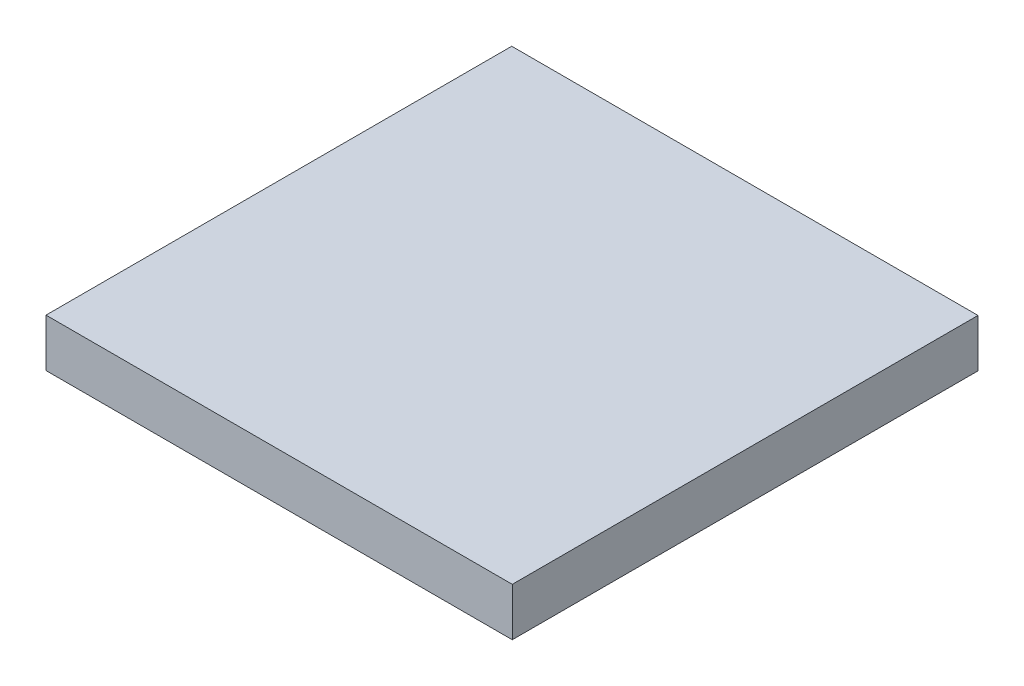
ISO-10303-21;
HEADER;
FILE_DESCRIPTION(('STEP AP214'),'2;1');
FILE_NAME('part.step','',(''),(''),'','','');
FILE_SCHEMA(('AUTOMOTIVE_DESIGN { 1 0 10303 214 1 1 1 1 }'));
ENDSEC;
DATA;
#1=APPLICATION_CONTEXT('core data for automotive mechanical design processes');
#2=APPLICATION_PROTOCOL_DEFINITION('international standard','automotive_design',2000,#1);
#3=PRODUCT_CONTEXT('',#1,'mechanical');
#4=PRODUCT('Part','Part','',(#3));
#5=PRODUCT_RELATED_PRODUCT_CATEGORY('part','',(#4));
#6=PRODUCT_DEFINITION_FORMATION('','',#4);
#7=PRODUCT_DEFINITION_CONTEXT('part definition',#1,'design');
#8=PRODUCT_DEFINITION('design','',#6,#7);
#9=PRODUCT_DEFINITION_SHAPE('','',#8);
#10=(LENGTH_UNIT() NAMED_UNIT(*) SI_UNIT(.MILLI.,.METRE.));
#11=(NAMED_UNIT(*) PLANE_ANGLE_UNIT() SI_UNIT($,.RADIAN.));
#12=(NAMED_UNIT(*) SI_UNIT($,.STERADIAN.) SOLID_ANGLE_UNIT());
#13=UNCERTAINTY_MEASURE_WITH_UNIT(LENGTH_MEASURE(1.E-05),#10,'distance_accuracy_value','');
#14=(GEOMETRIC_REPRESENTATION_CONTEXT(3) GLOBAL_UNCERTAINTY_ASSIGNED_CONTEXT((#13)) GLOBAL_UNIT_ASSIGNED_CONTEXT((#10,
#11,#12)) REPRESENTATION_CONTEXT('',''));
#15=CARTESIAN_POINT('',(0.,0.,0.));
#16=DIRECTION('',(0.,0.,1.));
#17=DIRECTION('',(1.,0.,0.));
#18=AXIS2_PLACEMENT_3D('',#15,#16,#17);
#19=CARTESIAN_POINT('',(0.,0.,0.));
#20=DIRECTION('',(0.,-1.,0.));
#21=DIRECTION('',(0.,0.,-1.));
#22=AXIS2_PLACEMENT_3D('',#19,#20,#21);
#23=PLANE('',#22);
#24=CARTESIAN_POINT('',(23.4823,0.,-118.7323));
#25=DIRECTION('',(0.,-1.,0.));
#26=DIRECTION('',(0.,0.,-1.));
#27=AXIS2_PLACEMENT_3D('',#24,#25,#26);
#28=CIRCLE('',#27,1.5113);
#29=CARTESIAN_POINT('',(23.4823,0.,-120.2436));
#30=VERTEX_POINT('',#29);
#31=EDGE_CURVE('E495',#30,#30,#28,.T.);
#32=ORIENTED_EDGE('',*,*,#31,.F.);
#33=EDGE_LOOP('',(#32));
#34=FACE_BOUND('',#33,.T.);
#35=CARTESIAN_POINT('',(119.7356,0.,-19.0499999999996));
#36=DIRECTION('',(0.,-1.,0.));
#37=DIRECTION('',(0.,0.,-1.));
#38=AXIS2_PLACEMENT_3D('',#35,#36,#37);
#39=CIRCLE('',#38,1.27000000000001);
#40=CARTESIAN_POINT('',(119.7356,0.,-20.3199999999996));
#41=VERTEX_POINT('',#40);
#42=EDGE_CURVE('E286',#41,#41,#39,.T.);
#43=ORIENTED_EDGE('',*,*,#42,.F.);
#44=EDGE_LOOP('',(#43));
#45=FACE_BOUND('',#44,.T.);
#46=CARTESIAN_POINT('',(119.735600000001,0.,-108.7882));
#47=DIRECTION('',(0.,-1.,0.));
#48=DIRECTION('',(0.,0.,1.));
#49=AXIS2_PLACEMENT_3D('',#46,#47,#48);
#50=CIRCLE('',#49,1.27000000000001);
#51=CARTESIAN_POINT('',(119.735600000001,0.,-107.5182));
#52=VERTEX_POINT('',#51);
#53=EDGE_CURVE('E290',#52,#52,#50,.T.);
#54=ORIENTED_EDGE('',*,*,#53,.F.);
#55=EDGE_LOOP('',(#54));
#56=FACE_BOUND('',#55,.T.);
#57=CARTESIAN_POINT('',(8.25499999999997,0.,-19.05));
#58=DIRECTION('',(0.,-1.,0.));
#59=DIRECTION('',(0.,0.,1.));
#60=AXIS2_PLACEMENT_3D('',#57,#58,#59);
#61=CIRCLE('',#60,1.27000000000001);
#62=CARTESIAN_POINT('',(8.25499999999997,0.,-17.78));
#63=VERTEX_POINT('',#62);
#64=EDGE_CURVE('E296',#63,#63,#61,.T.);
#65=ORIENTED_EDGE('',*,*,#64,.F.);
#66=EDGE_LOOP('',(#65));
#67=FACE_BOUND('',#66,.T.);
#68=CARTESIAN_POINT('',(8.25499999999997,0.,-108.7882));
#69=DIRECTION('',(0.,-1.,0.));
#70=DIRECTION('',(0.,0.,-1.));
#71=AXIS2_PLACEMENT_3D('',#68,#69,#70);
#72=CIRCLE('',#71,1.27000000000001);
#73=CARTESIAN_POINT('',(8.25499999999997,0.,-110.0582));
#74=VERTEX_POINT('',#73);
#75=EDGE_CURVE('E302',#74,#74,#72,.T.);
#76=ORIENTED_EDGE('',*,*,#75,.F.);
#77=EDGE_LOOP('',(#76));
#78=FACE_BOUND('',#77,.T.);
#79=DIRECTION('',(0.,0.,-1.));
#80=VECTOR('',#79,1.);
#81=CARTESIAN_POINT('',(12.7,0.,-12.7));
#82=LINE('',#81,#80);
#83=CARTESIAN_POINT('',(12.7,0.,-13.97));
#84=VERTEX_POINT('',#83);
#85=CARTESIAN_POINT('',(12.7,0.,-113.8682));
#86=VERTEX_POINT('',#85);
#87=EDGE_CURVE('E308',#84,#86,#82,.T.);
#88=ORIENTED_EDGE('',*,*,#87,.F.);
#89=CARTESIAN_POINT('',(13.97,0.,-13.97));
#90=DIRECTION('',(0.,-1.,0.));
#91=DIRECTION('',(0.,0.,-1.));
#92=AXIS2_PLACEMENT_3D('',#89,#90,#91);
#93=CIRCLE('',#92,1.27);
#94=CARTESIAN_POINT('',(13.97,0.,-12.7));
#95=VERTEX_POINT('',#94);
#96=EDGE_CURVE('E375',#84,#95,#93,.F.);
#97=ORIENTED_EDGE('',*,*,#96,.T.);
#98=DIRECTION('',(-1.,0.,0.));
#99=VECTOR('',#98,1.);
#100=CARTESIAN_POINT('',(12.7,0.,-12.7));
#101=LINE('',#100,#99);
#102=CARTESIAN_POINT('',(114.0206,0.,-12.7));
#103=VERTEX_POINT('',#102);
#104=EDGE_CURVE('E314',#103,#95,#101,.T.);
#105=ORIENTED_EDGE('',*,*,#104,.F.);
#106=CARTESIAN_POINT('',(114.0206,0.,-13.97));
#107=DIRECTION('',(0.,-1.,0.));
#108=DIRECTION('',(0.,0.,-1.));
#109=AXIS2_PLACEMENT_3D('',#106,#107,#108);
#110=CIRCLE('',#109,1.27);
#111=CARTESIAN_POINT('',(115.2906,0.,-13.97));
#112=VERTEX_POINT('',#111);
#113=EDGE_CURVE('E386',#103,#112,#110,.F.);
#114=ORIENTED_EDGE('',*,*,#113,.T.);
#115=DIRECTION('',(0.,0.,1.));
#116=VECTOR('',#115,1.);
#117=CARTESIAN_POINT('',(115.2906,0.,-12.7));
#118=LINE('',#117,#116);
#119=CARTESIAN_POINT('',(115.2906,0.,-113.8682));
#120=VERTEX_POINT('',#119);
#121=EDGE_CURVE('E324',#120,#112,#118,.T.);
#122=ORIENTED_EDGE('',*,*,#121,.F.);
#123=CARTESIAN_POINT('',(114.0206,0.,-113.8682));
#124=DIRECTION('',(0.,-1.,0.));
#125=DIRECTION('',(0.,0.,-1.));
#126=AXIS2_PLACEMENT_3D('',#123,#124,#125);
#127=CIRCLE('',#126,1.27);
#128=CARTESIAN_POINT('',(114.0206,0.,-115.1382));
#129=VERTEX_POINT('',#128);
#130=EDGE_CURVE('E50',#120,#129,#127,.F.);
#131=ORIENTED_EDGE('',*,*,#130,.T.);
#132=DIRECTION('',(1.,0.,0.));
#133=VECTOR('',#132,1.);
#134=CARTESIAN_POINT('',(12.7,0.,-115.1382));
#135=LINE('',#134,#133);
#136=CARTESIAN_POINT('',(13.97,0.,-115.1382));
#137=VERTEX_POINT('',#136);
#138=EDGE_CURVE('E322',#137,#129,#135,.T.);
#139=ORIENTED_EDGE('',*,*,#138,.F.);
#140=CARTESIAN_POINT('',(13.97,0.,-113.8682));
#141=DIRECTION('',(0.,-1.,0.));
#142=DIRECTION('',(0.,0.,-1.));
#143=AXIS2_PLACEMENT_3D('',#140,#141,#142);
#144=CIRCLE('',#143,1.27);
#145=EDGE_CURVE('E364',#137,#86,#144,.F.);
#146=ORIENTED_EDGE('',*,*,#145,.T.);
#147=EDGE_LOOP('',(#88,#97,#105,#114,#122,#131,#139,#146));
#148=FACE_BOUND('',#147,.T.);
#149=DIRECTION('',(0.,0.,1.));
#150=VECTOR('',#149,1.);
#151=CARTESIAN_POINT('',(0.,0.,0.));
#152=LINE('',#151,#150);
#153=CARTESIAN_POINT('',(0.,0.,-127.8382));
#154=VERTEX_POINT('',#153);
#155=CARTESIAN_POINT('',(0.,0.,0.));
#156=VERTEX_POINT('',#155);
#157=EDGE_CURVE('E320',#154,#156,#152,.T.);
#158=ORIENTED_EDGE('',*,*,#157,.F.);
#159=DIRECTION('',(-1.,0.,0.));
#160=VECTOR('',#159,1.);
#161=CARTESIAN_POINT('',(0.,0.,-127.8382));
#162=LINE('',#161,#160);
#163=CARTESIAN_POINT('',(127.9906,0.,-127.8382));
#164=VERTEX_POINT('',#163);
#165=EDGE_CURVE('E331',#164,#154,#162,.T.);
#166=ORIENTED_EDGE('',*,*,#165,.F.);
#167=DIRECTION('',(0.,0.,-1.));
#168=VECTOR('',#167,1.);
#169=CARTESIAN_POINT('',(127.9906,0.,0.));
#170=LINE('',#169,#168);
#171=CARTESIAN_POINT('',(127.9906,0.,0.));
#172=VERTEX_POINT('',#171);
#173=EDGE_CURVE('E342',#172,#164,#170,.T.);
#174=ORIENTED_EDGE('',*,*,#173,.F.);
#175=DIRECTION('',(1.,0.,0.));
#176=VECTOR('',#175,1.);
#177=CARTESIAN_POINT('',(0.,0.,0.));
#178=LINE('',#177,#176);
#179=EDGE_CURVE('E340',#156,#172,#178,.T.);
#180=ORIENTED_EDGE('',*,*,#179,.F.);
#181=EDGE_LOOP('',(#158,#166,#174,#180));
#182=FACE_BOUND('',#181,.T.);
#183=CARTESIAN_POINT('',(104.5083,0.,-9.10590000000028));
#184=DIRECTION('',(0.,-1.,0.));
#185=DIRECTION('',(0.,0.,-1.));
#186=AXIS2_PLACEMENT_3D('',#183,#184,#185);
#187=CIRCLE('',#186,1.51130000000001);
#188=CARTESIAN_POINT('',(104.5083,0.,-10.6172000000003));
#189=VERTEX_POINT('',#188);
#190=EDGE_CURVE('E493',#189,#189,#187,.T.);
#191=ORIENTED_EDGE('',*,*,#190,.F.);
#192=EDGE_LOOP('',(#191));
#193=FACE_BOUND('',#192,.T.);
#194=ADVANCED_FACE('F35',(#34,#45,#56,#67,#78,#148,#182,#193),#23,.T.);
#195=CARTESIAN_POINT('',(0.,7.874,0.));
#196=DIRECTION('',(0.,-1.,0.));
#197=DIRECTION('',(0.,0.,-1.));
#198=AXIS2_PLACEMENT_3D('',#195,#196,#197);
#199=PLANE('',#198);
#200=DIRECTION('',(1.,0.,0.));
#201=VECTOR('',#200,1.);
#202=CARTESIAN_POINT('',(13.2842,7.874,-79.9084));
#203=LINE('',#202,#201);
#204=CARTESIAN_POINT('',(13.2842,7.874,-79.9084));
#205=VERTEX_POINT('',#204);
#206=CARTESIAN_POINT('',(22.1742,7.874,-79.9084));
#207=VERTEX_POINT('',#206);
#208=EDGE_CURVE('E226',#205,#207,#203,.T.);
#209=ORIENTED_EDGE('',*,*,#208,.F.);
#210=DIRECTION('',(0.,0.,-1.));
#211=VECTOR('',#210,1.);
#212=CARTESIAN_POINT('',(13.2842,7.874,-51.9684));
#213=LINE('',#212,#211);
#214=CARTESIAN_POINT('',(13.2842,7.874,-51.9684));
#215=VERTEX_POINT('',#214);
#216=EDGE_CURVE('E223',#215,#205,#213,.T.);
#217=ORIENTED_EDGE('',*,*,#216,.F.);
#218=DIRECTION('',(-1.,0.,0.));
#219=VECTOR('',#218,1.);
#220=CARTESIAN_POINT('',(13.2842,7.874,-51.9684));
#221=LINE('',#220,#219);
#222=CARTESIAN_POINT('',(22.1742,7.874,-51.9684));
#223=VERTEX_POINT('',#222);
#224=EDGE_CURVE('E236',#223,#215,#221,.T.);
#225=ORIENTED_EDGE('',*,*,#224,.F.);
#226=DIRECTION('',(0.,0.,1.));
#227=VECTOR('',#226,1.);
#228=CARTESIAN_POINT('',(22.1742,7.874,-51.9684));
#229=LINE('',#228,#227);
#230=EDGE_CURVE('E244',#207,#223,#229,.T.);
#231=ORIENTED_EDGE('',*,*,#230,.F.);
#232=EDGE_LOOP('',(#209,#217,#225,#231));
#233=FACE_BOUND('',#232,.T.);
#234=DIRECTION('',(1.,0.,0.));
#235=VECTOR('',#234,1.);
#236=CARTESIAN_POINT('',(12.7,7.874,-115.1382));
#237=LINE('',#236,#235);
#238=CARTESIAN_POINT('',(13.97,7.874,-115.1382));
#239=VERTEX_POINT('',#238);
#240=CARTESIAN_POINT('',(114.0206,7.874,-115.1382));
#241=VERTEX_POINT('',#240);
#242=EDGE_CURVE('E313',#239,#241,#237,.T.);
#243=ORIENTED_EDGE('',*,*,#242,.T.);
#244=CARTESIAN_POINT('',(114.0206,7.874,-113.8682));
#245=DIRECTION('',(0.,-1.,0.));
#246=DIRECTION('',(0.,0.,-1.));
#247=AXIS2_PLACEMENT_3D('',#244,#245,#246);
#248=CIRCLE('',#247,1.27);
#249=CARTESIAN_POINT('',(115.2906,7.874,-113.8682));
#250=VERTEX_POINT('',#249);
#251=EDGE_CURVE('E393',#241,#250,#248,.T.);
#252=ORIENTED_EDGE('',*,*,#251,.T.);
#253=DIRECTION('',(0.,0.,1.));
#254=VECTOR('',#253,1.);
#255=CARTESIAN_POINT('',(115.2906,7.874,-12.7));
#256=LINE('',#255,#254);
#257=CARTESIAN_POINT('',(115.2906,7.874,-13.97));
#258=VERTEX_POINT('',#257);
#259=EDGE_CURVE('E316',#250,#258,#256,.T.);
#260=ORIENTED_EDGE('',*,*,#259,.T.);
#261=CARTESIAN_POINT('',(114.0206,7.874,-13.97));
#262=DIRECTION('',(0.,-1.,0.));
#263=DIRECTION('',(0.,0.,-1.));
#264=AXIS2_PLACEMENT_3D('',#261,#262,#263);
#265=CIRCLE('',#264,1.27);
#266=CARTESIAN_POINT('',(114.0206,7.874,-12.7));
#267=VERTEX_POINT('',#266);
#268=EDGE_CURVE('E384',#258,#267,#265,.T.);
#269=ORIENTED_EDGE('',*,*,#268,.T.);
#270=DIRECTION('',(-1.,0.,0.));
#271=VECTOR('',#270,1.);
#272=CARTESIAN_POINT('',(12.7,7.874,-12.7));
#273=LINE('',#272,#271);
#274=CARTESIAN_POINT('',(13.97,7.874,-12.7));
#275=VERTEX_POINT('',#274);
#276=EDGE_CURVE('E318',#267,#275,#273,.T.);
#277=ORIENTED_EDGE('',*,*,#276,.T.);
#278=CARTESIAN_POINT('',(13.97,7.874,-13.97));
#279=DIRECTION('',(0.,-1.,0.));
#280=DIRECTION('',(0.,0.,-1.));
#281=AXIS2_PLACEMENT_3D('',#278,#279,#280);
#282=CIRCLE('',#281,1.27);
#283=CARTESIAN_POINT('',(12.7,7.874,-13.97));
#284=VERTEX_POINT('',#283);
#285=EDGE_CURVE('E373',#275,#284,#282,.T.);
#286=ORIENTED_EDGE('',*,*,#285,.T.);
#287=DIRECTION('',(0.,0.,-1.));
#288=VECTOR('',#287,1.);
#289=CARTESIAN_POINT('',(12.7,7.874,-12.7));
#290=LINE('',#289,#288);
#291=CARTESIAN_POINT('',(12.7,7.874,-113.8682));
#292=VERTEX_POINT('',#291);
#293=EDGE_CURVE('E311',#284,#292,#290,.T.);
#294=ORIENTED_EDGE('',*,*,#293,.T.);
#295=CARTESIAN_POINT('',(13.97,7.874,-113.8682));
#296=DIRECTION('',(0.,-1.,0.));
#297=DIRECTION('',(0.,0.,-1.));
#298=AXIS2_PLACEMENT_3D('',#295,#296,#297);
#299=CIRCLE('',#298,1.27);
#300=EDGE_CURVE('E362',#292,#239,#299,.T.);
#301=ORIENTED_EDGE('',*,*,#300,.T.);
#302=EDGE_LOOP('',(#243,#252,#260,#269,#277,#286,#294,#301));
#303=FACE_BOUND('',#302,.T.);
#304=DIRECTION('',(1.,0.,0.));
#305=VECTOR('',#304,1.);
#306=CARTESIAN_POINT('',(34.5694,7.874,-77.1398));
#307=LINE('',#306,#305);
#308=CARTESIAN_POINT('',(34.5694,7.874,-77.1398));
#309=VERTEX_POINT('',#308);
#310=CARTESIAN_POINT('',(50.3682,7.874,-77.1398));
#311=VERTEX_POINT('',#310);
#312=EDGE_CURVE('E271',#309,#311,#307,.T.);
#313=ORIENTED_EDGE('',*,*,#312,.F.);
#314=DIRECTION('',(0.,0.,-1.));
#315=VECTOR('',#314,1.);
#316=CARTESIAN_POINT('',(34.5694,7.874,-68.8594));
#317=LINE('',#316,#315);
#318=CARTESIAN_POINT('',(34.5694,7.874,-68.8594));
#319=VERTEX_POINT('',#318);
#320=EDGE_CURVE('E257',#319,#309,#317,.T.);
#321=ORIENTED_EDGE('',*,*,#320,.F.);
#322=DIRECTION('',(-1.,0.,0.));
#323=VECTOR('',#322,1.);
#324=CARTESIAN_POINT('',(34.5694,7.874,-68.8594));
#325=LINE('',#324,#323);
#326=CARTESIAN_POINT('',(50.3682,7.874,-68.8594));
#327=VERTEX_POINT('',#326);
#328=EDGE_CURVE('E262',#327,#319,#325,.T.);
#329=ORIENTED_EDGE('',*,*,#328,.F.);
#330=DIRECTION('',(0.,0.,1.));
#331=VECTOR('',#330,1.);
#332=CARTESIAN_POINT('',(50.3682,7.874,-68.8594));
#333=LINE('',#332,#331);
#334=EDGE_CURVE('E273',#311,#327,#333,.T.);
#335=ORIENTED_EDGE('',*,*,#334,.F.);
#336=EDGE_LOOP('',(#313,#321,#329,#335));
#337=FACE_BOUND('',#336,.T.);
#338=DIRECTION('',(-1.,0.,0.));
#339=VECTOR('',#338,1.);
#340=CARTESIAN_POINT('',(114.7064,7.874,-51.9683999999997));
#341=LINE('',#340,#339);
#342=CARTESIAN_POINT('',(114.7064,7.874,-51.9683999999997));
#343=VERTEX_POINT('',#342);
#344=CARTESIAN_POINT('',(105.8164,7.874,-51.9683999999997));
#345=VERTEX_POINT('',#344);
#346=EDGE_CURVE('E504',#343,#345,#341,.T.);
#347=ORIENTED_EDGE('',*,*,#346,.F.);
#348=DIRECTION('',(0.,0.,1.));
#349=VECTOR('',#348,1.);
#350=CARTESIAN_POINT('',(114.7064,7.874,-51.9683999999997));
#351=LINE('',#350,#349);
#352=CARTESIAN_POINT('',(114.7064,7.874,-79.9083999999997));
#353=VERTEX_POINT('',#352);
#354=EDGE_CURVE('E221',#353,#343,#351,.T.);
#355=ORIENTED_EDGE('',*,*,#354,.F.);
#356=DIRECTION('',(1.,0.,0.));
#357=VECTOR('',#356,1.);
#358=CARTESIAN_POINT('',(114.7064,7.874,-79.9083999999997));
#359=LINE('',#358,#357);
#360=CARTESIAN_POINT('',(105.8164,7.874,-79.9083999999997));
#361=VERTEX_POINT('',#360);
#362=EDGE_CURVE('E217',#361,#353,#359,.T.);
#363=ORIENTED_EDGE('',*,*,#362,.F.);
#364=DIRECTION('',(0.,0.,-1.));
#365=VECTOR('',#364,1.);
#366=CARTESIAN_POINT('',(105.8164,7.874,-51.9683999999997));
#367=LINE('',#366,#365);
#368=EDGE_CURVE('E506',#345,#361,#367,.T.);
#369=ORIENTED_EDGE('',*,*,#368,.F.);
#370=EDGE_LOOP('',(#347,#355,#363,#369));
#371=FACE_BOUND('',#370,.T.);
#372=ADVANCED_FACE('F416',(#233,#303,#337,#371),#199,.T.);
#373=CARTESIAN_POINT('',(0.,13.1826,0.));
#374=DIRECTION('',(1.,0.,0.));
#375=DIRECTION('',(0.,0.,-1.));
#376=AXIS2_PLACEMENT_3D('',#373,#374,#375);
#377=PLANE('',#376);
#378=ORIENTED_EDGE('',*,*,#157,.T.);
#379=DIRECTION('',(0.,-1.,0.));
#380=VECTOR('',#379,1.);
#381=CARTESIAN_POINT('',(0.,13.1826,0.));
#382=LINE('',#381,#380);
#383=CARTESIAN_POINT('',(0.,13.1826,0.));
#384=VERTEX_POINT('',#383);
#385=EDGE_CURVE('E353',#384,#156,#382,.T.);
#386=ORIENTED_EDGE('',*,*,#385,.F.);
#387=DIRECTION('',(0.,0.,1.));
#388=VECTOR('',#387,1.);
#389=CARTESIAN_POINT('',(0.,13.1826,0.));
#390=LINE('',#389,#388);
#391=CARTESIAN_POINT('',(0.,13.1826,-127.8382));
#392=VERTEX_POINT('',#391);
#393=EDGE_CURVE('E327',#392,#384,#390,.T.);
#394=ORIENTED_EDGE('',*,*,#393,.F.);
#395=DIRECTION('',(0.,-1.,0.));
#396=VECTOR('',#395,1.);
#397=CARTESIAN_POINT('',(0.,13.1826,-127.8382));
#398=LINE('',#397,#396);
#399=EDGE_CURVE('E337',#392,#154,#398,.T.);
#400=ORIENTED_EDGE('',*,*,#399,.T.);
#401=EDGE_LOOP('',(#378,#386,#394,#400));
#402=FACE_BOUND('',#401,.T.);
#403=ADVANCED_FACE('F422',(#402),#377,.F.);
#404=CARTESIAN_POINT('',(0.,13.1826,0.));
#405=DIRECTION('',(0.,0.,-1.));
#406=DIRECTION('',(-1.,0.,0.));
#407=AXIS2_PLACEMENT_3D('',#404,#405,#406);
#408=PLANE('',#407);
#409=ORIENTED_EDGE('',*,*,#179,.T.);
#410=DIRECTION('',(0.,-1.,0.));
#411=VECTOR('',#410,1.);
#412=CARTESIAN_POINT('',(127.9906,13.1826,0.));
#413=LINE('',#412,#411);
#414=CARTESIAN_POINT('',(127.9906,13.1826,0.));
#415=VERTEX_POINT('',#414);
#416=EDGE_CURVE('E350',#415,#172,#413,.T.);
#417=ORIENTED_EDGE('',*,*,#416,.F.);
#418=DIRECTION('',(1.,0.,0.));
#419=VECTOR('',#418,1.);
#420=CARTESIAN_POINT('',(0.,13.1826,0.));
#421=LINE('',#420,#419);
#422=EDGE_CURVE('E330',#384,#415,#421,.T.);
#423=ORIENTED_EDGE('',*,*,#422,.F.);
#424=ORIENTED_EDGE('',*,*,#385,.T.);
#425=EDGE_LOOP('',(#409,#417,#423,#424));
#426=FACE_BOUND('',#425,.T.);
#427=ADVANCED_FACE('F438',(#426),#408,.F.);
#428=CARTESIAN_POINT('',(127.9906,13.1826,0.));
#429=DIRECTION('',(-1.,0.,0.));
#430=DIRECTION('',(0.,0.,1.));
#431=AXIS2_PLACEMENT_3D('',#428,#429,#430);
#432=PLANE('',#431);
#433=ORIENTED_EDGE('',*,*,#173,.T.);
#434=DIRECTION('',(0.,-1.,0.));
#435=VECTOR('',#434,1.);
#436=CARTESIAN_POINT('',(127.9906,13.1826,-127.8382));
#437=LINE('',#436,#435);
#438=CARTESIAN_POINT('',(127.9906,13.1826,-127.8382));
#439=VERTEX_POINT('',#438);
#440=EDGE_CURVE('E347',#439,#164,#437,.T.);
#441=ORIENTED_EDGE('',*,*,#440,.F.);
#442=DIRECTION('',(0.,0.,-1.));
#443=VECTOR('',#442,1.);
#444=CARTESIAN_POINT('',(127.9906,13.1826,0.));
#445=LINE('',#444,#443);
#446=EDGE_CURVE('E333',#415,#439,#445,.T.);
#447=ORIENTED_EDGE('',*,*,#446,.F.);
#448=ORIENTED_EDGE('',*,*,#416,.T.);
#449=EDGE_LOOP('',(#433,#441,#447,#448));
#450=FACE_BOUND('',#449,.T.);
#451=ADVANCED_FACE('F434',(#450),#432,.F.);
#452=CARTESIAN_POINT('',(0.,13.1826,-127.8382));
#453=DIRECTION('',(0.,0.,1.));
#454=DIRECTION('',(1.,0.,0.));
#455=AXIS2_PLACEMENT_3D('',#452,#453,#454);
#456=PLANE('',#455);
#457=ORIENTED_EDGE('',*,*,#165,.T.);
#458=ORIENTED_EDGE('',*,*,#399,.F.);
#459=DIRECTION('',(-1.,0.,0.));
#460=VECTOR('',#459,1.);
#461=CARTESIAN_POINT('',(0.,13.1826,-127.8382));
#462=LINE('',#461,#460);
#463=EDGE_CURVE('E335',#439,#392,#462,.T.);
#464=ORIENTED_EDGE('',*,*,#463,.F.);
#465=ORIENTED_EDGE('',*,*,#440,.T.);
#466=EDGE_LOOP('',(#457,#458,#464,#465));
#467=FACE_BOUND('',#466,.T.);
#468=ADVANCED_FACE('F431',(#467),#456,.F.);
#469=CARTESIAN_POINT('',(0.,13.1826,0.));
#470=DIRECTION('',(0.,-1.,0.));
#471=DIRECTION('',(0.,0.,-1.));
#472=AXIS2_PLACEMENT_3D('',#469,#470,#471);
#473=PLANE('',#472);
#474=ORIENTED_EDGE('',*,*,#393,.T.);
#475=ORIENTED_EDGE('',*,*,#422,.T.);
#476=ORIENTED_EDGE('',*,*,#446,.T.);
#477=ORIENTED_EDGE('',*,*,#463,.T.);
#478=EDGE_LOOP('',(#474,#475,#476,#477));
#479=FACE_BOUND('',#478,.T.);
#480=ADVANCED_FACE('F429',(#479),#473,.F.);
#481=CARTESIAN_POINT('',(12.7,7.874,-12.7));
#482=DIRECTION('',(-1.,0.,0.));
#483=DIRECTION('',(0.,0.,1.));
#484=AXIS2_PLACEMENT_3D('',#481,#482,#483);
#485=PLANE('',#484);
#486=ORIENTED_EDGE('',*,*,#293,.F.);
#487=DIRECTION('',(0.,-1.,0.));
#488=VECTOR('',#487,1.);
#489=CARTESIAN_POINT('',(12.7,0.,-13.97));
#490=LINE('',#489,#488);
#491=EDGE_CURVE('E367',#284,#84,#490,.T.);
#492=ORIENTED_EDGE('',*,*,#491,.T.);
#493=ORIENTED_EDGE('',*,*,#87,.T.);
#494=DIRECTION('',(0.,-1.,0.));
#495=VECTOR('',#494,1.);
#496=CARTESIAN_POINT('',(12.7,7.874,-113.8682));
#497=LINE('',#496,#495);
#498=EDGE_CURVE('E359',#86,#292,#497,.F.);
#499=ORIENTED_EDGE('',*,*,#498,.T.);
#500=EDGE_LOOP('',(#486,#492,#493,#499));
#501=FACE_BOUND('',#500,.T.);
#502=ADVANCED_FACE('F481',(#501),#485,.F.);
#503=CARTESIAN_POINT('',(12.7,7.874,-12.7));
#504=DIRECTION('',(0.,0.,1.));
#505=DIRECTION('',(1.,0.,0.));
#506=AXIS2_PLACEMENT_3D('',#503,#504,#505);
#507=PLANE('',#506);
#508=ORIENTED_EDGE('',*,*,#276,.F.);
#509=DIRECTION('',(0.,-1.,0.));
#510=VECTOR('',#509,1.);
#511=CARTESIAN_POINT('',(114.0206,0.,-12.7));
#512=LINE('',#511,#510);
#513=EDGE_CURVE('E378',#267,#103,#512,.T.);
#514=ORIENTED_EDGE('',*,*,#513,.T.);
#515=ORIENTED_EDGE('',*,*,#104,.T.);
#516=DIRECTION('',(0.,-1.,0.));
#517=VECTOR('',#516,1.);
#518=CARTESIAN_POINT('',(13.97,7.874,-12.7));
#519=LINE('',#518,#517);
#520=EDGE_CURVE('E370',#95,#275,#519,.F.);
#521=ORIENTED_EDGE('',*,*,#520,.T.);
#522=EDGE_LOOP('',(#508,#514,#515,#521));
#523=FACE_BOUND('',#522,.T.);
#524=ADVANCED_FACE('F474',(#523),#507,.F.);
#525=CARTESIAN_POINT('',(115.2906,7.874,-12.7));
#526=DIRECTION('',(1.,0.,0.));
#527=DIRECTION('',(0.,0.,-1.));
#528=AXIS2_PLACEMENT_3D('',#525,#526,#527);
#529=PLANE('',#528);
#530=ORIENTED_EDGE('',*,*,#259,.F.);
#531=DIRECTION('',(0.,-1.,0.));
#532=VECTOR('',#531,1.);
#533=CARTESIAN_POINT('',(115.2906,0.,-113.8682));
#534=LINE('',#533,#532);
#535=EDGE_CURVE('E389',#250,#120,#534,.T.);
#536=ORIENTED_EDGE('',*,*,#535,.T.);
#537=ORIENTED_EDGE('',*,*,#121,.T.);
#538=DIRECTION('',(0.,-1.,0.));
#539=VECTOR('',#538,1.);
#540=CARTESIAN_POINT('',(115.2906,7.874,-13.97));
#541=LINE('',#540,#539);
#542=EDGE_CURVE('E381',#112,#258,#541,.F.);
#543=ORIENTED_EDGE('',*,*,#542,.T.);
#544=EDGE_LOOP('',(#530,#536,#537,#543));
#545=FACE_BOUND('',#544,.T.);
#546=ADVANCED_FACE('F468',(#545),#529,.F.);
#547=CARTESIAN_POINT('',(12.7,7.874,-115.1382));
#548=DIRECTION('',(0.,0.,-1.));
#549=DIRECTION('',(-1.,0.,0.));
#550=AXIS2_PLACEMENT_3D('',#547,#548,#549);
#551=PLANE('',#550);
#552=ORIENTED_EDGE('',*,*,#138,.T.);
#553=DIRECTION('',(0.,-1.,0.));
#554=VECTOR('',#553,1.);
#555=CARTESIAN_POINT('',(114.0206,7.874,-115.1382));
#556=LINE('',#555,#554);
#557=EDGE_CURVE('E57',#129,#241,#556,.F.);
#558=ORIENTED_EDGE('',*,*,#557,.T.);
#559=ORIENTED_EDGE('',*,*,#242,.F.);
#560=DIRECTION('',(0.,-1.,0.));
#561=VECTOR('',#560,1.);
#562=CARTESIAN_POINT('',(13.97,0.,-115.1382));
#563=LINE('',#562,#561);
#564=EDGE_CURVE('E356',#239,#137,#563,.T.);
#565=ORIENTED_EDGE('',*,*,#564,.T.);
#566=EDGE_LOOP('',(#552,#558,#559,#565));
#567=FACE_BOUND('',#566,.T.);
#568=ADVANCED_FACE('F486',(#567),#551,.F.);
#569=CARTESIAN_POINT('',(8.25499999999997,7.874,-108.7882));
#570=DIRECTION('',(0.,-1.,0.));
#571=DIRECTION('',(0.,0.,-1.));
#572=AXIS2_PLACEMENT_3D('',#569,#570,#571);
#573=CYLINDRICAL_SURFACE('',#572,1.27000000000001);
#574=CARTESIAN_POINT('',(8.25499999999997,7.874,-108.7882));
#575=DIRECTION('',(0.,-1.,0.));
#576=DIRECTION('',(0.,0.,-1.));
#577=AXIS2_PLACEMENT_3D('',#574,#575,#576);
#578=CIRCLE('',#577,1.27000000000001);
#579=CARTESIAN_POINT('',(8.25499999999997,7.874,-110.0582));
#580=VERTEX_POINT('',#579);
#581=EDGE_CURVE('E305',#580,#580,#578,.T.);
#582=ORIENTED_EDGE('',*,*,#581,.F.);
#583=EDGE_LOOP('',(#582));
#584=FACE_BOUND('',#583,.T.);
#585=ORIENTED_EDGE('',*,*,#75,.T.);
#586=EDGE_LOOP('',(#585));
#587=FACE_BOUND('',#586,.T.);
#588=ADVANCED_FACE('F597',(#584,#587),#573,.F.);
#589=CARTESIAN_POINT('',(8.25499999999997,7.874,-108.7882));
#590=DIRECTION('',(0.,-1.,0.));
#591=DIRECTION('',(0.,0.,-1.));
#592=AXIS2_PLACEMENT_3D('',#589,#590,#591);
#593=PLANE('',#592);
#594=ORIENTED_EDGE('',*,*,#581,.T.);
#595=EDGE_LOOP('',(#594));
#596=FACE_BOUND('',#595,.T.);
#597=ADVANCED_FACE('F593',(#596),#593,.T.);
#598=CARTESIAN_POINT('',(8.25499999999997,7.874,-19.05));
#599=DIRECTION('',(0.,-1.,0.));
#600=DIRECTION('',(0.,0.,-1.));
#601=AXIS2_PLACEMENT_3D('',#598,#599,#600);
#602=CYLINDRICAL_SURFACE('',#601,1.27000000000001);
#603=CARTESIAN_POINT('',(8.25499999999997,7.874,-19.05));
#604=DIRECTION('',(0.,-1.,0.));
#605=DIRECTION('',(0.,0.,1.));
#606=AXIS2_PLACEMENT_3D('',#603,#604,#605);
#607=CIRCLE('',#606,1.27000000000001);
#608=CARTESIAN_POINT('',(8.25499999999997,7.874,-17.78));
#609=VERTEX_POINT('',#608);
#610=EDGE_CURVE('E299',#609,#609,#607,.T.);
#611=ORIENTED_EDGE('',*,*,#610,.F.);
#612=EDGE_LOOP('',(#611));
#613=FACE_BOUND('',#612,.T.);
#614=ORIENTED_EDGE('',*,*,#64,.T.);
#615=EDGE_LOOP('',(#614));
#616=FACE_BOUND('',#615,.T.);
#617=ADVANCED_FACE('F589',(#613,#616),#602,.F.);
#618=CARTESIAN_POINT('',(8.25499999999997,7.874,-19.05));
#619=DIRECTION('',(0.,1.,0.));
#620=DIRECTION('',(0.,0.,1.));
#621=AXIS2_PLACEMENT_3D('',#618,#619,#620);
#622=PLANE('',#621);
#623=ORIENTED_EDGE('',*,*,#610,.T.);
#624=EDGE_LOOP('',(#623));
#625=FACE_BOUND('',#624,.T.);
#626=ADVANCED_FACE('F585',(#625),#622,.F.);
#627=CARTESIAN_POINT('',(119.735600000001,7.874,-108.7882));
#628=DIRECTION('',(0.,-1.,0.));
#629=DIRECTION('',(0.,0.,-1.));
#630=AXIS2_PLACEMENT_3D('',#627,#628,#629);
#631=CYLINDRICAL_SURFACE('',#630,1.27000000000001);
#632=CARTESIAN_POINT('',(119.735600000001,7.874,-108.7882));
#633=DIRECTION('',(0.,-1.,0.));
#634=DIRECTION('',(0.,0.,1.));
#635=AXIS2_PLACEMENT_3D('',#632,#633,#634);
#636=CIRCLE('',#635,1.27000000000001);
#637=CARTESIAN_POINT('',(119.735600000001,7.874,-107.5182));
#638=VERTEX_POINT('',#637);
#639=EDGE_CURVE('E293',#638,#638,#636,.T.);
#640=ORIENTED_EDGE('',*,*,#639,.F.);
#641=EDGE_LOOP('',(#640));
#642=FACE_BOUND('',#641,.T.);
#643=ORIENTED_EDGE('',*,*,#53,.T.);
#644=EDGE_LOOP('',(#643));
#645=FACE_BOUND('',#644,.T.);
#646=ADVANCED_FACE('F581',(#642,#645),#631,.F.);
#647=CARTESIAN_POINT('',(119.735600000001,7.874,-108.7882));
#648=DIRECTION('',(0.,1.,0.));
#649=DIRECTION('',(0.,0.,1.));
#650=AXIS2_PLACEMENT_3D('',#647,#648,#649);
#651=PLANE('',#650);
#652=ORIENTED_EDGE('',*,*,#639,.T.);
#653=EDGE_LOOP('',(#652));
#654=FACE_BOUND('',#653,.T.);
#655=ADVANCED_FACE('F577',(#654),#651,.F.);
#656=CARTESIAN_POINT('',(119.7356,7.874,-19.0499999999996));
#657=DIRECTION('',(0.,-1.,0.));
#658=DIRECTION('',(0.,0.,-1.));
#659=AXIS2_PLACEMENT_3D('',#656,#657,#658);
#660=CYLINDRICAL_SURFACE('',#659,1.27000000000001);
#661=CARTESIAN_POINT('',(119.7356,7.874,-19.0499999999996));
#662=DIRECTION('',(0.,-1.,0.));
#663=DIRECTION('',(0.,0.,-1.));
#664=AXIS2_PLACEMENT_3D('',#661,#662,#663);
#665=CIRCLE('',#664,1.27000000000001);
#666=CARTESIAN_POINT('',(119.7356,7.874,-20.3199999999996));
#667=VERTEX_POINT('',#666);
#668=EDGE_CURVE('E287',#667,#667,#665,.T.);
#669=ORIENTED_EDGE('',*,*,#668,.F.);
#670=EDGE_LOOP('',(#669));
#671=FACE_BOUND('',#670,.T.);
#672=ORIENTED_EDGE('',*,*,#42,.T.);
#673=EDGE_LOOP('',(#672));
#674=FACE_BOUND('',#673,.T.);
#675=ADVANCED_FACE('F573',(#671,#674),#660,.F.);
#676=CARTESIAN_POINT('',(119.7356,7.874,-19.0499999999996));
#677=DIRECTION('',(0.,-1.,0.));
#678=DIRECTION('',(0.,0.,-1.));
#679=AXIS2_PLACEMENT_3D('',#676,#677,#678);
#680=PLANE('',#679);
#681=ORIENTED_EDGE('',*,*,#668,.T.);
#682=EDGE_LOOP('',(#681));
#683=FACE_BOUND('',#682,.T.);
#684=ADVANCED_FACE('F569',(#683),#680,.T.);
#685=CARTESIAN_POINT('',(34.5694,-1.9558,-68.8594));
#686=DIRECTION('',(1.,0.,0.));
#687=DIRECTION('',(0.,0.,-1.));
#688=AXIS2_PLACEMENT_3D('',#685,#686,#687);
#689=PLANE('',#688);
#690=ORIENTED_EDGE('',*,*,#320,.T.);
#691=DIRECTION('',(0.,1.,0.));
#692=VECTOR('',#691,1.);
#693=CARTESIAN_POINT('',(34.5694,-1.9558,-77.1398));
#694=LINE('',#693,#692);
#695=CARTESIAN_POINT('',(34.5694,-1.9558,-77.1398));
#696=VERTEX_POINT('',#695);
#697=EDGE_CURVE('E284',#696,#309,#694,.T.);
#698=ORIENTED_EDGE('',*,*,#697,.F.);
#699=DIRECTION('',(0.,0.,-1.));
#700=VECTOR('',#699,1.);
#701=CARTESIAN_POINT('',(34.5694,-1.9558,-68.8594));
#702=LINE('',#701,#700);
#703=CARTESIAN_POINT('',(34.5694,-1.9558,-68.8594));
#704=VERTEX_POINT('',#703);
#705=EDGE_CURVE('E258',#704,#696,#702,.T.);
#706=ORIENTED_EDGE('',*,*,#705,.F.);
#707=DIRECTION('',(0.,1.,0.));
#708=VECTOR('',#707,1.);
#709=CARTESIAN_POINT('',(34.5694,-1.9558,-68.8594));
#710=LINE('',#709,#708);
#711=EDGE_CURVE('E268',#704,#319,#710,.T.);
#712=ORIENTED_EDGE('',*,*,#711,.T.);
#713=EDGE_LOOP('',(#690,#698,#706,#712));
#714=FACE_BOUND('',#713,.T.);
#715=ADVANCED_FACE('F565',(#714),#689,.F.);
#716=CARTESIAN_POINT('',(34.5694,-1.9558,-77.1398));
#717=DIRECTION('',(0.,0.,1.));
#718=DIRECTION('',(1.,0.,0.));
#719=AXIS2_PLACEMENT_3D('',#716,#717,#718);
#720=PLANE('',#719);
#721=ORIENTED_EDGE('',*,*,#312,.T.);
#722=DIRECTION('',(0.,1.,0.));
#723=VECTOR('',#722,1.);
#724=CARTESIAN_POINT('',(50.3682,-1.9558,-77.1398));
#725=LINE('',#724,#723);
#726=CARTESIAN_POINT('',(50.3682,-1.9558,-77.1398));
#727=VERTEX_POINT('',#726);
#728=EDGE_CURVE('E281',#727,#311,#725,.T.);
#729=ORIENTED_EDGE('',*,*,#728,.F.);
#730=DIRECTION('',(1.,0.,0.));
#731=VECTOR('',#730,1.);
#732=CARTESIAN_POINT('',(34.5694,-1.9558,-77.1398));
#733=LINE('',#732,#731);
#734=EDGE_CURVE('E261',#696,#727,#733,.T.);
#735=ORIENTED_EDGE('',*,*,#734,.F.);
#736=ORIENTED_EDGE('',*,*,#697,.T.);
#737=EDGE_LOOP('',(#721,#729,#735,#736));
#738=FACE_BOUND('',#737,.T.);
#739=ADVANCED_FACE('F561',(#738),#720,.F.);
#740=CARTESIAN_POINT('',(50.3682,-1.9558,-68.8594));
#741=DIRECTION('',(-1.,0.,0.));
#742=DIRECTION('',(0.,0.,1.));
#743=AXIS2_PLACEMENT_3D('',#740,#741,#742);
#744=PLANE('',#743);
#745=ORIENTED_EDGE('',*,*,#334,.T.);
#746=DIRECTION('',(0.,1.,0.));
#747=VECTOR('',#746,1.);
#748=CARTESIAN_POINT('',(50.3682,-1.9558,-68.8594));
#749=LINE('',#748,#747);
#750=CARTESIAN_POINT('',(50.3682,-1.9558,-68.8594));
#751=VERTEX_POINT('',#750);
#752=EDGE_CURVE('E279',#751,#327,#749,.T.);
#753=ORIENTED_EDGE('',*,*,#752,.F.);
#754=DIRECTION('',(0.,0.,1.));
#755=VECTOR('',#754,1.);
#756=CARTESIAN_POINT('',(50.3682,-1.9558,-68.8594));
#757=LINE('',#756,#755);
#758=EDGE_CURVE('E264',#727,#751,#757,.T.);
#759=ORIENTED_EDGE('',*,*,#758,.F.);
#760=ORIENTED_EDGE('',*,*,#728,.T.);
#761=EDGE_LOOP('',(#745,#753,#759,#760));
#762=FACE_BOUND('',#761,.T.);
#763=ADVANCED_FACE('F557',(#762),#744,.F.);
#764=CARTESIAN_POINT('',(34.5694,-1.9558,-68.8594));
#765=DIRECTION('',(0.,0.,-1.));
#766=DIRECTION('',(-1.,0.,0.));
#767=AXIS2_PLACEMENT_3D('',#764,#765,#766);
#768=PLANE('',#767);
#769=ORIENTED_EDGE('',*,*,#328,.T.);
#770=ORIENTED_EDGE('',*,*,#711,.F.);
#771=DIRECTION('',(-1.,0.,0.));
#772=VECTOR('',#771,1.);
#773=CARTESIAN_POINT('',(34.5694,-1.9558,-68.8594));
#774=LINE('',#773,#772);
#775=EDGE_CURVE('E266',#751,#704,#774,.T.);
#776=ORIENTED_EDGE('',*,*,#775,.F.);
#777=ORIENTED_EDGE('',*,*,#752,.T.);
#778=EDGE_LOOP('',(#769,#770,#776,#777));
#779=FACE_BOUND('',#778,.T.);
#780=ADVANCED_FACE('F553',(#779),#768,.F.);
#781=CARTESIAN_POINT('',(0.,-1.9558,0.));
#782=DIRECTION('',(0.,-1.,0.));
#783=DIRECTION('',(0.,0.,-1.));
#784=AXIS2_PLACEMENT_3D('',#781,#782,#783);
#785=PLANE('',#784);
#786=ORIENTED_EDGE('',*,*,#705,.T.);
#787=ORIENTED_EDGE('',*,*,#734,.T.);
#788=ORIENTED_EDGE('',*,*,#758,.T.);
#789=ORIENTED_EDGE('',*,*,#775,.T.);
#790=EDGE_LOOP('',(#786,#787,#788,#789));
#791=FACE_BOUND('',#790,.T.);
#792=ADVANCED_FACE('F549',(#791),#785,.T.);
#793=CARTESIAN_POINT('',(13.2842,0.,-51.9684));
#794=DIRECTION('',(1.,0.,0.));
#795=DIRECTION('',(0.,0.,-1.));
#796=AXIS2_PLACEMENT_3D('',#793,#794,#795);
#797=PLANE('',#796);
#798=ORIENTED_EDGE('',*,*,#216,.T.);
#799=DIRECTION('',(0.,1.,0.));
#800=VECTOR('',#799,1.);
#801=CARTESIAN_POINT('',(13.2842,0.,-79.9084));
#802=LINE('',#801,#800);
#803=CARTESIAN_POINT('',(13.2842,0.,-79.9084));
#804=VERTEX_POINT('',#803);
#805=EDGE_CURVE('E255',#804,#205,#802,.T.);
#806=ORIENTED_EDGE('',*,*,#805,.F.);
#807=DIRECTION('',(0.,0.,-1.));
#808=VECTOR('',#807,1.);
#809=CARTESIAN_POINT('',(13.2842,0.,-51.9684));
#810=LINE('',#809,#808);
#811=CARTESIAN_POINT('',(13.2842,0.,-51.9684));
#812=VERTEX_POINT('',#811);
#813=EDGE_CURVE('E232',#812,#804,#810,.T.);
#814=ORIENTED_EDGE('',*,*,#813,.F.);
#815=DIRECTION('',(0.,1.,0.));
#816=VECTOR('',#815,1.);
#817=CARTESIAN_POINT('',(13.2842,0.,-51.9684));
#818=LINE('',#817,#816);
#819=EDGE_CURVE('E241',#812,#215,#818,.T.);
#820=ORIENTED_EDGE('',*,*,#819,.T.);
#821=EDGE_LOOP('',(#798,#806,#814,#820));
#822=FACE_BOUND('',#821,.T.);
#823=ADVANCED_FACE('F545',(#822),#797,.F.);
#824=CARTESIAN_POINT('',(13.2842,0.,-79.9084));
#825=DIRECTION('',(0.,0.,1.));
#826=DIRECTION('',(1.,0.,0.));
#827=AXIS2_PLACEMENT_3D('',#824,#825,#826);
#828=PLANE('',#827);
#829=ORIENTED_EDGE('',*,*,#208,.T.);
#830=DIRECTION('',(0.,1.,0.));
#831=VECTOR('',#830,1.);
#832=CARTESIAN_POINT('',(22.1742,0.,-79.9084));
#833=LINE('',#832,#831);
#834=CARTESIAN_POINT('',(22.1742,0.,-79.9084));
#835=VERTEX_POINT('',#834);
#836=EDGE_CURVE('E252',#835,#207,#833,.T.);
#837=ORIENTED_EDGE('',*,*,#836,.F.);
#838=DIRECTION('',(1.,0.,0.));
#839=VECTOR('',#838,1.);
#840=CARTESIAN_POINT('',(13.2842,0.,-79.9084));
#841=LINE('',#840,#839);
#842=EDGE_CURVE('E235',#804,#835,#841,.T.);
#843=ORIENTED_EDGE('',*,*,#842,.F.);
#844=ORIENTED_EDGE('',*,*,#805,.T.);
#845=EDGE_LOOP('',(#829,#837,#843,#844));
#846=FACE_BOUND('',#845,.T.);
#847=ADVANCED_FACE('F541',(#846),#828,.F.);
#848=CARTESIAN_POINT('',(22.1742,0.,-51.9684));
#849=DIRECTION('',(-1.,0.,0.));
#850=DIRECTION('',(0.,0.,1.));
#851=AXIS2_PLACEMENT_3D('',#848,#849,#850);
#852=PLANE('',#851);
#853=ORIENTED_EDGE('',*,*,#230,.T.);
#854=DIRECTION('',(0.,1.,0.));
#855=VECTOR('',#854,1.);
#856=CARTESIAN_POINT('',(22.1742,0.,-51.9684));
#857=LINE('',#856,#855);
#858=CARTESIAN_POINT('',(22.1742,0.,-51.9684));
#859=VERTEX_POINT('',#858);
#860=EDGE_CURVE('E250',#859,#223,#857,.T.);
#861=ORIENTED_EDGE('',*,*,#860,.F.);
#862=DIRECTION('',(0.,0.,1.));
#863=VECTOR('',#862,1.);
#864=CARTESIAN_POINT('',(22.1742,0.,-51.9684));
#865=LINE('',#864,#863);
#866=EDGE_CURVE('E238',#835,#859,#865,.T.);
#867=ORIENTED_EDGE('',*,*,#866,.F.);
#868=ORIENTED_EDGE('',*,*,#836,.T.);
#869=EDGE_LOOP('',(#853,#861,#867,#868));
#870=FACE_BOUND('',#869,.T.);
#871=ADVANCED_FACE('F537',(#870),#852,.F.);
#872=CARTESIAN_POINT('',(13.2842,0.,-51.9684));
#873=DIRECTION('',(0.,0.,-1.));
#874=DIRECTION('',(-1.,0.,0.));
#875=AXIS2_PLACEMENT_3D('',#872,#873,#874);
#876=PLANE('',#875);
#877=ORIENTED_EDGE('',*,*,#224,.T.);
#878=ORIENTED_EDGE('',*,*,#819,.F.);
#879=DIRECTION('',(-1.,0.,0.));
#880=VECTOR('',#879,1.);
#881=CARTESIAN_POINT('',(13.2842,0.,-51.9684));
#882=LINE('',#881,#880);
#883=EDGE_CURVE('E240',#859,#812,#882,.T.);
#884=ORIENTED_EDGE('',*,*,#883,.F.);
#885=ORIENTED_EDGE('',*,*,#860,.T.);
#886=EDGE_LOOP('',(#877,#878,#884,#885));
#887=FACE_BOUND('',#886,.T.);
#888=ADVANCED_FACE('F533',(#887),#876,.F.);
#889=CARTESIAN_POINT('',(0.,0.,0.));
#890=DIRECTION('',(0.,-1.,0.));
#891=DIRECTION('',(0.,0.,-1.));
#892=AXIS2_PLACEMENT_3D('',#889,#890,#891);
#893=PLANE('',#892);
#894=ORIENTED_EDGE('',*,*,#813,.T.);
#895=ORIENTED_EDGE('',*,*,#842,.T.);
#896=ORIENTED_EDGE('',*,*,#866,.T.);
#897=ORIENTED_EDGE('',*,*,#883,.T.);
#898=EDGE_LOOP('',(#894,#895,#896,#897));
#899=FACE_BOUND('',#898,.T.);
#900=ADVANCED_FACE('F530',(#899),#893,.T.);
#901=CARTESIAN_POINT('',(114.7064,0.,-51.9683999999997));
#902=DIRECTION('',(-1.,0.,0.));
#903=DIRECTION('',(0.,0.,1.));
#904=AXIS2_PLACEMENT_3D('',#901,#902,#903);
#905=PLANE('',#904);
#906=ORIENTED_EDGE('',*,*,#354,.T.);
#907=DIRECTION('',(0.,1.,0.));
#908=VECTOR('',#907,1.);
#909=CARTESIAN_POINT('',(114.7064,0.,-51.9683999999997));
#910=LINE('',#909,#908);
#911=CARTESIAN_POINT('',(114.7064,0.,-51.9683999999997));
#912=VERTEX_POINT('',#911);
#913=EDGE_CURVE('E201',#912,#343,#910,.T.);
#914=ORIENTED_EDGE('',*,*,#913,.F.);
#915=DIRECTION('',(0.,0.,1.));
#916=VECTOR('',#915,1.);
#917=CARTESIAN_POINT('',(114.7064,0.,-51.9683999999997));
#918=LINE('',#917,#916);
#919=CARTESIAN_POINT('',(114.7064,0.,-79.9083999999997));
#920=VERTEX_POINT('',#919);
#921=EDGE_CURVE('E208',#920,#912,#918,.T.);
#922=ORIENTED_EDGE('',*,*,#921,.F.);
#923=DIRECTION('',(0.,1.,0.));
#924=VECTOR('',#923,1.);
#925=CARTESIAN_POINT('',(114.7064,0.,-79.9083999999997));
#926=LINE('',#925,#924);
#927=EDGE_CURVE('E502',#920,#353,#926,.T.);
#928=ORIENTED_EDGE('',*,*,#927,.T.);
#929=EDGE_LOOP('',(#906,#914,#922,#928));
#930=FACE_BOUND('',#929,.T.);
#931=ADVANCED_FACE('F219',(#930),#905,.F.);
#932=CARTESIAN_POINT('',(114.7064,0.,-51.9683999999997));
#933=DIRECTION('',(0.,0.,-1.));
#934=DIRECTION('',(-1.,0.,0.));
#935=AXIS2_PLACEMENT_3D('',#932,#933,#934);
#936=PLANE('',#935);
#937=ORIENTED_EDGE('',*,*,#346,.T.);
#938=DIRECTION('',(0.,1.,0.));
#939=VECTOR('',#938,1.);
#940=CARTESIAN_POINT('',(105.8164,0.,-51.9683999999997));
#941=LINE('',#940,#939);
#942=CARTESIAN_POINT('',(105.8164,0.,-51.9683999999997));
#943=VERTEX_POINT('',#942);
#944=EDGE_CURVE('E204',#943,#345,#941,.T.);
#945=ORIENTED_EDGE('',*,*,#944,.F.);
#946=DIRECTION('',(-1.,0.,0.));
#947=VECTOR('',#946,1.);
#948=CARTESIAN_POINT('',(114.7064,0.,-51.9683999999997));
#949=LINE('',#948,#947);
#950=EDGE_CURVE('E197',#912,#943,#949,.T.);
#951=ORIENTED_EDGE('',*,*,#950,.F.);
#952=ORIENTED_EDGE('',*,*,#913,.T.);
#953=EDGE_LOOP('',(#937,#945,#951,#952));
#954=FACE_BOUND('',#953,.T.);
#955=ADVANCED_FACE('F199',(#954),#936,.F.);
#956=CARTESIAN_POINT('',(105.8164,0.,-51.9683999999997));
#957=DIRECTION('',(1.,0.,0.));
#958=DIRECTION('',(0.,0.,-1.));
#959=AXIS2_PLACEMENT_3D('',#956,#957,#958);
#960=PLANE('',#959);
#961=ORIENTED_EDGE('',*,*,#368,.T.);
#962=DIRECTION('',(0.,1.,0.));
#963=VECTOR('',#962,1.);
#964=CARTESIAN_POINT('',(105.8164,0.,-79.9083999999997));
#965=LINE('',#964,#963);
#966=CARTESIAN_POINT('',(105.8164,0.,-79.9083999999997));
#967=VERTEX_POINT('',#966);
#968=EDGE_CURVE('E228',#967,#361,#965,.T.);
#969=ORIENTED_EDGE('',*,*,#968,.F.);
#970=DIRECTION('',(0.,0.,-1.));
#971=VECTOR('',#970,1.);
#972=CARTESIAN_POINT('',(105.8164,0.,-51.9683999999997));
#973=LINE('',#972,#971);
#974=EDGE_CURVE('E207',#943,#967,#973,.T.);
#975=ORIENTED_EDGE('',*,*,#974,.F.);
#976=ORIENTED_EDGE('',*,*,#944,.T.);
#977=EDGE_LOOP('',(#961,#969,#975,#976));
#978=FACE_BOUND('',#977,.T.);
#979=ADVANCED_FACE('F516',(#978),#960,.F.);
#980=CARTESIAN_POINT('',(114.7064,0.,-79.9083999999997));
#981=DIRECTION('',(0.,0.,1.));
#982=DIRECTION('',(1.,0.,0.));
#983=AXIS2_PLACEMENT_3D('',#980,#981,#982);
#984=PLANE('',#983);
#985=ORIENTED_EDGE('',*,*,#362,.T.);
#986=ORIENTED_EDGE('',*,*,#927,.F.);
#987=DIRECTION('',(1.,0.,0.));
#988=VECTOR('',#987,1.);
#989=CARTESIAN_POINT('',(114.7064,0.,-79.9083999999997));
#990=LINE('',#989,#988);
#991=EDGE_CURVE('E213',#967,#920,#990,.T.);
#992=ORIENTED_EDGE('',*,*,#991,.F.);
#993=ORIENTED_EDGE('',*,*,#968,.T.);
#994=EDGE_LOOP('',(#985,#986,#992,#993));
#995=FACE_BOUND('',#994,.T.);
#996=ADVANCED_FACE('F512',(#995),#984,.F.);
#997=CARTESIAN_POINT('',(0.,0.,0.));
#998=DIRECTION('',(0.,1.,0.));
#999=DIRECTION('',(0.,0.,1.));
#1000=AXIS2_PLACEMENT_3D('',#997,#998,#999);
#1001=PLANE('',#1000);
#1002=ORIENTED_EDGE('',*,*,#921,.T.);
#1003=ORIENTED_EDGE('',*,*,#950,.T.);
#1004=ORIENTED_EDGE('',*,*,#974,.T.);
#1005=ORIENTED_EDGE('',*,*,#991,.T.);
#1006=EDGE_LOOP('',(#1002,#1003,#1004,#1005));
#1007=FACE_BOUND('',#1006,.T.);
#1008=ADVANCED_FACE('F211',(#1007),#1001,.F.);
#1009=CARTESIAN_POINT('',(23.4823,-3.683,-118.7323));
#1010=DIRECTION('',(0.,1.,0.));
#1011=DIRECTION('',(0.,0.,1.));
#1012=AXIS2_PLACEMENT_3D('',#1009,#1010,#1011);
#1013=CYLINDRICAL_SURFACE('',#1012,1.5113);
#1014=CARTESIAN_POINT('',(23.4823,-2.413,-118.7323));
#1015=DIRECTION('',(0.,-1.,0.));
#1016=DIRECTION('',(0.,0.,-1.));
#1017=AXIS2_PLACEMENT_3D('',#1014,#1015,#1016);
#1018=CIRCLE('',#1017,1.5113);
#1019=CARTESIAN_POINT('',(23.4823,-2.413,-120.2436));
#1020=VERTEX_POINT('',#1019);
#1021=EDGE_CURVE('E399',#1020,#1020,#1018,.F.);
#1022=ORIENTED_EDGE('',*,*,#1021,.T.);
#1023=EDGE_LOOP('',(#1022));
#1024=FACE_BOUND('',#1023,.T.);
#1025=ORIENTED_EDGE('',*,*,#31,.T.);
#1026=EDGE_LOOP('',(#1025));
#1027=FACE_BOUND('',#1026,.T.);
#1028=ADVANCED_FACE('F673',(#1024,#1027),#1013,.T.);
#1029=CARTESIAN_POINT('',(23.4823,-3.683,-118.7323));
#1030=DIRECTION('',(0.,-1.,0.));
#1031=DIRECTION('',(0.,0.,-1.));
#1032=AXIS2_PLACEMENT_3D('',#1029,#1030,#1031);
#1033=PLANE('',#1032);
#1034=CARTESIAN_POINT('',(23.4823,-3.683,-118.7323));
#1035=DIRECTION('',(0.,-1.,0.));
#1036=DIRECTION('',(0.,0.,-1.));
#1037=AXIS2_PLACEMENT_3D('',#1034,#1035,#1036);
#1038=CIRCLE('',#1037,0.2413);
#1039=CARTESIAN_POINT('',(23.4823,-3.683,-118.9736));
#1040=VERTEX_POINT('',#1039);
#1041=EDGE_CURVE('E396',#1040,#1040,#1038,.T.);
#1042=ORIENTED_EDGE('',*,*,#1041,.T.);
#1043=EDGE_LOOP('',(#1042));
#1044=FACE_BOUND('',#1043,.T.);
#1045=ADVANCED_FACE('F678',(#1044),#1033,.T.);
#1046=CARTESIAN_POINT('',(104.5083,-3.683,-9.10590000000028));
#1047=DIRECTION('',(0.,1.,0.));
#1048=DIRECTION('',(0.,0.,1.));
#1049=AXIS2_PLACEMENT_3D('',#1046,#1047,#1048);
#1050=CYLINDRICAL_SURFACE('',#1049,1.51130000000001);
#1051=CARTESIAN_POINT('',(104.5083,-2.413,-9.10590000000028));
#1052=DIRECTION('',(0.,-1.,0.));
#1053=DIRECTION('',(0.,0.,-1.));
#1054=AXIS2_PLACEMENT_3D('',#1051,#1052,#1053);
#1055=CIRCLE('',#1054,1.51130000000001);
#1056=CARTESIAN_POINT('',(104.5083,-2.413,-10.6172000000003));
#1057=VERTEX_POINT('',#1056);
#1058=EDGE_CURVE('E11',#1057,#1057,#1055,.F.);
#1059=ORIENTED_EDGE('',*,*,#1058,.T.);
#1060=EDGE_LOOP('',(#1059));
#1061=FACE_BOUND('',#1060,.T.);
#1062=ORIENTED_EDGE('',*,*,#190,.T.);
#1063=EDGE_LOOP('',(#1062));
#1064=FACE_BOUND('',#1063,.T.);
#1065=ADVANCED_FACE('F689',(#1061,#1064),#1050,.T.);
#1066=CARTESIAN_POINT('',(104.5083,-3.683,-9.10590000000028));
#1067=DIRECTION('',(0.,-1.,0.));
#1068=DIRECTION('',(0.,0.,-1.));
#1069=AXIS2_PLACEMENT_3D('',#1066,#1067,#1068);
#1070=PLANE('',#1069);
#1071=CARTESIAN_POINT('',(104.5083,-3.683,-9.10590000000028));
#1072=DIRECTION('',(0.,-1.,0.));
#1073=DIRECTION('',(0.,0.,-1.));
#1074=AXIS2_PLACEMENT_3D('',#1071,#1072,#1073);
#1075=CIRCLE('',#1074,0.241300000000013);
#1076=CARTESIAN_POINT('',(104.5083,-3.683,-9.34720000000029));
#1077=VERTEX_POINT('',#1076);
#1078=EDGE_CURVE('E43',#1077,#1077,#1075,.T.);
#1079=ORIENTED_EDGE('',*,*,#1078,.T.);
#1080=EDGE_LOOP('',(#1079));
#1081=FACE_BOUND('',#1080,.T.);
#1082=ADVANCED_FACE('F404',(#1081),#1070,.T.);
#1083=CARTESIAN_POINT('',(13.97,7.874,-113.8682));
#1084=DIRECTION('',(0.,1.,0.));
#1085=DIRECTION('',(0.,0.,1.));
#1086=AXIS2_PLACEMENT_3D('',#1083,#1084,#1085);
#1087=CYLINDRICAL_SURFACE('',#1086,1.27);
#1088=ORIENTED_EDGE('',*,*,#300,.F.);
#1089=ORIENTED_EDGE('',*,*,#498,.F.);
#1090=ORIENTED_EDGE('',*,*,#145,.F.);
#1091=ORIENTED_EDGE('',*,*,#564,.F.);
#1092=EDGE_LOOP('',(#1088,#1089,#1090,#1091));
#1093=FACE_BOUND('',#1092,.T.);
#1094=ADVANCED_FACE('F446',(#1093),#1087,.F.);
#1095=CARTESIAN_POINT('',(13.97,7.874,-13.97));
#1096=DIRECTION('',(0.,1.,0.));
#1097=DIRECTION('',(0.,0.,1.));
#1098=AXIS2_PLACEMENT_3D('',#1095,#1096,#1097);
#1099=CYLINDRICAL_SURFACE('',#1098,1.27);
#1100=ORIENTED_EDGE('',*,*,#285,.F.);
#1101=ORIENTED_EDGE('',*,*,#520,.F.);
#1102=ORIENTED_EDGE('',*,*,#96,.F.);
#1103=ORIENTED_EDGE('',*,*,#491,.F.);
#1104=EDGE_LOOP('',(#1100,#1101,#1102,#1103));
#1105=FACE_BOUND('',#1104,.T.);
#1106=ADVANCED_FACE('F449',(#1105),#1099,.F.);
#1107=CARTESIAN_POINT('',(114.0206,7.874,-13.97));
#1108=DIRECTION('',(0.,1.,0.));
#1109=DIRECTION('',(0.,0.,1.));
#1110=AXIS2_PLACEMENT_3D('',#1107,#1108,#1109);
#1111=CYLINDRICAL_SURFACE('',#1110,1.27);
#1112=ORIENTED_EDGE('',*,*,#268,.F.);
#1113=ORIENTED_EDGE('',*,*,#542,.F.);
#1114=ORIENTED_EDGE('',*,*,#113,.F.);
#1115=ORIENTED_EDGE('',*,*,#513,.F.);
#1116=EDGE_LOOP('',(#1112,#1113,#1114,#1115));
#1117=FACE_BOUND('',#1116,.T.);
#1118=ADVANCED_FACE('F453',(#1117),#1111,.F.);
#1119=CARTESIAN_POINT('',(114.0206,7.874,-113.8682));
#1120=DIRECTION('',(0.,1.,0.));
#1121=DIRECTION('',(0.,0.,1.));
#1122=AXIS2_PLACEMENT_3D('',#1119,#1120,#1121);
#1123=CYLINDRICAL_SURFACE('',#1122,1.27);
#1124=ORIENTED_EDGE('',*,*,#251,.F.);
#1125=ORIENTED_EDGE('',*,*,#557,.F.);
#1126=ORIENTED_EDGE('',*,*,#130,.F.);
#1127=ORIENTED_EDGE('',*,*,#535,.F.);
#1128=EDGE_LOOP('',(#1124,#1125,#1126,#1127));
#1129=FACE_BOUND('',#1128,.T.);
#1130=ADVANCED_FACE('F412',(#1129),#1123,.F.);
#1131=CARTESIAN_POINT('',(23.4823,-2.413,-118.7323));
#1132=DIRECTION('',(0.,-1.,0.));
#1133=DIRECTION('',(0.,0.,-1.));
#1134=AXIS2_PLACEMENT_3D('',#1131,#1132,#1133);
#1135=DEGENERATE_TOROIDAL_SURFACE('',#1134,0.2413,1.27,.T.);
#1136=ORIENTED_EDGE('',*,*,#1021,.F.);
#1137=EDGE_LOOP('',(#1136));
#1138=FACE_BOUND('',#1137,.T.);
#1139=ORIENTED_EDGE('',*,*,#1041,.F.);
#1140=EDGE_LOOP('',(#1139));
#1141=FACE_BOUND('',#1140,.T.);
#1142=ADVANCED_FACE('F407',(#1138,#1141),#1135,.T.);
#1143=CARTESIAN_POINT('',(104.5083,-2.413,-9.10590000000028));
#1144=DIRECTION('',(0.,-1.,0.));
#1145=DIRECTION('',(0.,0.,-1.));
#1146=AXIS2_PLACEMENT_3D('',#1143,#1144,#1145);
#1147=DEGENERATE_TOROIDAL_SURFACE('',#1146,0.241300000000013,1.27,.T.);
#1148=ORIENTED_EDGE('',*,*,#1058,.F.);
#1149=EDGE_LOOP('',(#1148));
#1150=FACE_BOUND('',#1149,.T.);
#1151=ORIENTED_EDGE('',*,*,#1078,.F.);
#1152=EDGE_LOOP('',(#1151));
#1153=FACE_BOUND('',#1152,.T.);
#1154=ADVANCED_FACE('F37',(#1150,#1153),#1147,.T.);
#1155=CLOSED_SHELL('',(#194,#372,#403,#427,#451,#468,#480,#502,#524,#546,#568,#588,#597,#617,
#626,#646,#655,#675,#684,#715,#739,#763,#780,#792,#823,#847,#871,#888,#900,#931,#955,#979,#996,
#1008,#1028,#1045,#1065,#1082,#1094,#1106,#1118,#1130,#1142,#1154));
#1156=MANIFOLD_SOLID_BREP('B2',#1155);
#1157=ADVANCED_BREP_SHAPE_REPRESENTATION('',(#18,#1156),#14);
#1158=SHAPE_DEFINITION_REPRESENTATION(#9,#1157);
ENDSEC;
END-ISO-10303-21;
